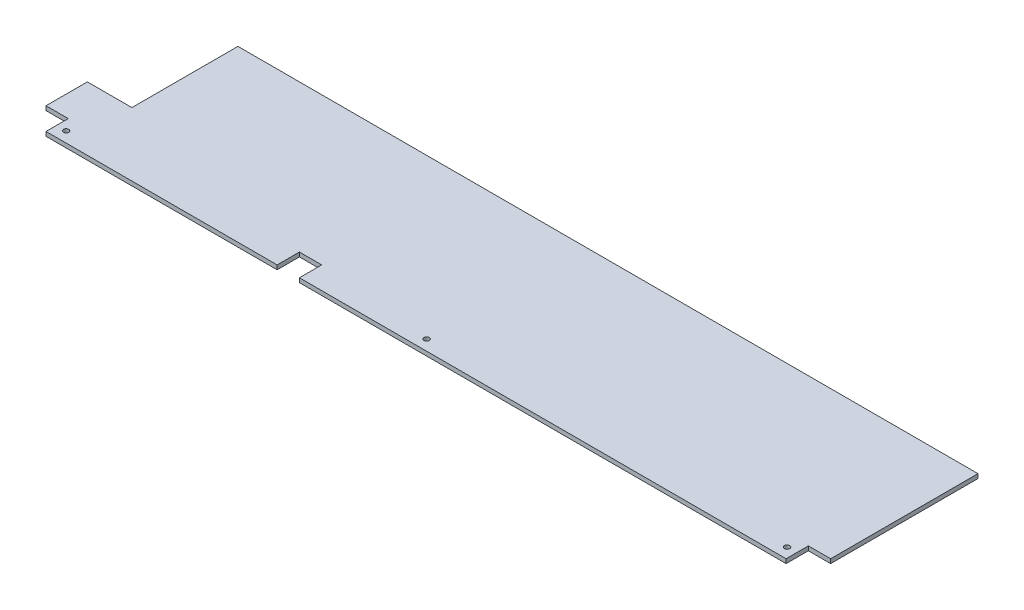
ISO-10303-21;
HEADER;
FILE_DESCRIPTION(('STEP AP214'),'2;1');
FILE_NAME('part.step','',(''),(''),'','','');
FILE_SCHEMA(('AUTOMOTIVE_DESIGN { 1 0 10303 214 1 1 1 1 }'));
ENDSEC;
DATA;
#1=APPLICATION_CONTEXT('core data for automotive mechanical design processes');
#2=APPLICATION_PROTOCOL_DEFINITION('international standard','automotive_design',2000,#1);
#3=PRODUCT_CONTEXT('',#1,'mechanical');
#4=PRODUCT('Part','Part','',(#3));
#5=PRODUCT_RELATED_PRODUCT_CATEGORY('part','',(#4));
#6=PRODUCT_DEFINITION_FORMATION('','',#4);
#7=PRODUCT_DEFINITION_CONTEXT('part definition',#1,'design');
#8=PRODUCT_DEFINITION('design','',#6,#7);
#9=PRODUCT_DEFINITION_SHAPE('','',#8);
#10=(LENGTH_UNIT() NAMED_UNIT(*) SI_UNIT(.MILLI.,.METRE.));
#11=(NAMED_UNIT(*) PLANE_ANGLE_UNIT() SI_UNIT($,.RADIAN.));
#12=(NAMED_UNIT(*) SI_UNIT($,.STERADIAN.) SOLID_ANGLE_UNIT());
#13=UNCERTAINTY_MEASURE_WITH_UNIT(LENGTH_MEASURE(1.E-05),#10,'distance_accuracy_value','');
#14=(GEOMETRIC_REPRESENTATION_CONTEXT(3) GLOBAL_UNCERTAINTY_ASSIGNED_CONTEXT((#13)) GLOBAL_UNIT_ASSIGNED_CONTEXT((#10,
#11,#12)) REPRESENTATION_CONTEXT('',''));
#15=CARTESIAN_POINT('',(0.,0.,0.));
#16=DIRECTION('',(0.,0.,1.));
#17=DIRECTION('',(1.,0.,0.));
#18=AXIS2_PLACEMENT_3D('',#15,#16,#17);
#19=CARTESIAN_POINT('',(0.,4.,0.));
#20=DIRECTION('',(0.,1.,0.));
#21=DIRECTION('',(0.,0.,1.));
#22=AXIS2_PLACEMENT_3D('',#19,#20,#21);
#23=PLANE('',#22);
#24=CARTESIAN_POINT('',(0.,4.,80.0000000000001));
#25=DIRECTION('',(0.,1.,0.));
#26=DIRECTION('',(0.,0.,-1.));
#27=AXIS2_PLACEMENT_3D('',#24,#25,#26);
#28=CIRCLE('',#27,2.5);
#29=CARTESIAN_POINT('',(0.,4.,77.5000000000001));
#30=VERTEX_POINT('',#29);
#31=EDGE_CURVE('E359',#30,#30,#28,.T.);
#32=ORIENTED_EDGE('',*,*,#31,.F.);
#33=EDGE_LOOP('',(#32));
#34=FACE_BOUND('',#33,.T.);
#35=DIRECTION('',(0.,0.,1.));
#36=VECTOR('',#35,1.);
#37=CARTESIAN_POINT('',(-328.,4.,-70.));
#38=LINE('',#37,#36);
#39=CARTESIAN_POINT('',(-328.,4.,-70.));
#40=VERTEX_POINT('',#39);
#41=CARTESIAN_POINT('',(-328.,4.,30.));
#42=VERTEX_POINT('',#41);
#43=EDGE_CURVE('E218',#40,#42,#38,.T.);
#44=ORIENTED_EDGE('',*,*,#43,.T.);
#45=DIRECTION('',(-1.,0.,0.));
#46=VECTOR('',#45,1.);
#47=CARTESIAN_POINT('',(-370.,4.,30.));
#48=LINE('',#47,#46);
#49=CARTESIAN_POINT('',(-370.,4.,30.));
#50=VERTEX_POINT('',#49);
#51=EDGE_CURVE('E118',#42,#50,#48,.T.);
#52=ORIENTED_EDGE('',*,*,#51,.T.);
#53=DIRECTION('',(0.,0.,1.));
#54=VECTOR('',#53,1.);
#55=CARTESIAN_POINT('',(-370.,4.,69.));
#56=LINE('',#55,#54);
#57=CARTESIAN_POINT('',(-370.,4.,69.));
#58=VERTEX_POINT('',#57);
#59=EDGE_CURVE('E263',#50,#58,#56,.T.);
#60=ORIENTED_EDGE('',*,*,#59,.T.);
#61=DIRECTION('',(1.,0.,0.));
#62=VECTOR('',#61,1.);
#63=CARTESIAN_POINT('',(-370.,4.,69.));
#64=LINE('',#63,#62);
#65=CARTESIAN_POINT('',(-349.,4.,69.));
#66=VERTEX_POINT('',#65);
#67=EDGE_CURVE('E283',#58,#66,#64,.T.);
#68=ORIENTED_EDGE('',*,*,#67,.T.);
#69=DIRECTION('',(0.,0.,1.));
#70=VECTOR('',#69,1.);
#71=CARTESIAN_POINT('',(-349.,4.,90.));
#72=LINE('',#71,#70);
#73=CARTESIAN_POINT('',(-349.,4.,90.));
#74=VERTEX_POINT('',#73);
#75=EDGE_CURVE('E279',#66,#74,#72,.T.);
#76=ORIENTED_EDGE('',*,*,#75,.T.);
#77=DIRECTION('',(1.,0.,0.));
#78=VECTOR('',#77,1.);
#79=CARTESIAN_POINT('',(-349.,4.,90.));
#80=LINE('',#79,#78);
#81=CARTESIAN_POINT('',(-131.,4.,90.));
#82=VERTEX_POINT('',#81);
#83=EDGE_CURVE('E282',#74,#82,#80,.T.);
#84=ORIENTED_EDGE('',*,*,#83,.T.);
#85=DIRECTION('',(0.,0.,-1.));
#86=VECTOR('',#85,1.);
#87=CARTESIAN_POINT('',(-131.,4.,90.));
#88=LINE('',#87,#86);
#89=CARTESIAN_POINT('',(-131.,4.,69.));
#90=VERTEX_POINT('',#89);
#91=EDGE_CURVE('E287',#82,#90,#88,.T.);
#92=ORIENTED_EDGE('',*,*,#91,.T.);
#93=DIRECTION('',(1.,0.,0.));
#94=VECTOR('',#93,1.);
#95=CARTESIAN_POINT('',(-131.,4.,69.));
#96=LINE('',#95,#94);
#97=CARTESIAN_POINT('',(-110.,4.,69.));
#98=VERTEX_POINT('',#97);
#99=EDGE_CURVE('E294',#90,#98,#96,.T.);
#100=ORIENTED_EDGE('',*,*,#99,.T.);
#101=DIRECTION('',(0.,0.,1.));
#102=VECTOR('',#101,1.);
#103=CARTESIAN_POINT('',(-110.,4.,90.));
#104=LINE('',#103,#102);
#105=CARTESIAN_POINT('',(-110.,4.,90.));
#106=VERTEX_POINT('',#105);
#107=EDGE_CURVE('E297',#98,#106,#104,.T.);
#108=ORIENTED_EDGE('',*,*,#107,.T.);
#109=DIRECTION('',(1.,0.,0.));
#110=VECTOR('',#109,1.);
#111=CARTESIAN_POINT('',(-110.,4.,90.));
#112=LINE('',#111,#110);
#113=CARTESIAN_POINT('',(349.,4.,90.));
#114=VERTEX_POINT('',#113);
#115=EDGE_CURVE('E300',#106,#114,#112,.T.);
#116=ORIENTED_EDGE('',*,*,#115,.T.);
#117=DIRECTION('',(0.,0.,-1.));
#118=VECTOR('',#117,1.);
#119=CARTESIAN_POINT('',(349.,4.,90.));
#120=LINE('',#119,#118);
#121=CARTESIAN_POINT('',(349.,4.,69.));
#122=VERTEX_POINT('',#121);
#123=EDGE_CURVE('E155',#114,#122,#120,.T.);
#124=ORIENTED_EDGE('',*,*,#123,.T.);
#125=DIRECTION('',(1.,0.,0.));
#126=VECTOR('',#125,1.);
#127=CARTESIAN_POINT('',(349.,4.,69.));
#128=LINE('',#127,#126);
#129=CARTESIAN_POINT('',(370.,4.,69.));
#130=VERTEX_POINT('',#129);
#131=EDGE_CURVE('E149',#122,#130,#128,.T.);
#132=ORIENTED_EDGE('',*,*,#131,.T.);
#133=DIRECTION('',(0.,0.,-1.));
#134=VECTOR('',#133,1.);
#135=CARTESIAN_POINT('',(370.,4.,69.));
#136=LINE('',#135,#134);
#137=CARTESIAN_POINT('',(370.,4.,-70.));
#138=VERTEX_POINT('',#137);
#139=EDGE_CURVE('E153',#130,#138,#136,.T.);
#140=ORIENTED_EDGE('',*,*,#139,.T.);
#141=DIRECTION('',(-1.,0.,0.));
#142=VECTOR('',#141,1.);
#143=CARTESIAN_POINT('',(-328.,4.,-70.));
#144=LINE('',#143,#142);
#145=EDGE_CURVE('E57',#138,#40,#144,.T.);
#146=ORIENTED_EDGE('',*,*,#145,.T.);
#147=EDGE_LOOP('',(#44,#52,#60,#68,#76,#84,#92,#100,#108,#116,#124,#132,#140,#146));
#148=FACE_BOUND('',#147,.T.);
#149=CARTESIAN_POINT('',(-340.,4.,80.));
#150=DIRECTION('',(0.,1.,0.));
#151=DIRECTION('',(0.,0.,-1.));
#152=AXIS2_PLACEMENT_3D('',#149,#150,#151);
#153=CIRCLE('',#152,2.50000000000002);
#154=CARTESIAN_POINT('',(-340.,4.,77.5));
#155=VERTEX_POINT('',#154);
#156=EDGE_CURVE('E182',#155,#155,#153,.T.);
#157=ORIENTED_EDGE('',*,*,#156,.F.);
#158=EDGE_LOOP('',(#157));
#159=FACE_BOUND('',#158,.T.);
#160=CARTESIAN_POINT('',(340.,4.,80.0000000000001));
#161=DIRECTION('',(0.,1.,0.));
#162=DIRECTION('',(0.,0.,1.));
#163=AXIS2_PLACEMENT_3D('',#160,#161,#162);
#164=CIRCLE('',#163,2.50000000000002);
#165=CARTESIAN_POINT('',(340.,4.,82.5000000000001));
#166=VERTEX_POINT('',#165);
#167=EDGE_CURVE('E348',#166,#166,#164,.T.);
#168=ORIENTED_EDGE('',*,*,#167,.F.);
#169=EDGE_LOOP('',(#168));
#170=FACE_BOUND('',#169,.T.);
#171=ADVANCED_FACE('F39',(#34,#148,#159,#170),#23,.T.);
#172=CARTESIAN_POINT('',(0.,0.,0.));
#173=DIRECTION('',(0.,1.,0.));
#174=DIRECTION('',(0.,0.,1.));
#175=AXIS2_PLACEMENT_3D('',#172,#173,#174);
#176=PLANE('',#175);
#177=DIRECTION('',(0.,0.,1.));
#178=VECTOR('',#177,1.);
#179=CARTESIAN_POINT('',(-328.,0.,-70.));
#180=LINE('',#179,#178);
#181=CARTESIAN_POINT('',(-328.,0.,-70.));
#182=VERTEX_POINT('',#181);
#183=CARTESIAN_POINT('',(-328.,0.,30.));
#184=VERTEX_POINT('',#183);
#185=EDGE_CURVE('E177',#182,#184,#180,.T.);
#186=ORIENTED_EDGE('',*,*,#185,.F.);
#187=DIRECTION('',(-1.,0.,0.));
#188=VECTOR('',#187,1.);
#189=CARTESIAN_POINT('',(-328.,0.,-70.));
#190=LINE('',#189,#188);
#191=CARTESIAN_POINT('',(370.,0.,-70.));
#192=VERTEX_POINT('',#191);
#193=EDGE_CURVE('E110',#192,#182,#190,.T.);
#194=ORIENTED_EDGE('',*,*,#193,.F.);
#195=DIRECTION('',(0.,0.,-1.));
#196=VECTOR('',#195,1.);
#197=CARTESIAN_POINT('',(370.,0.,69.));
#198=LINE('',#197,#196);
#199=CARTESIAN_POINT('',(370.,0.,69.));
#200=VERTEX_POINT('',#199);
#201=EDGE_CURVE('E104',#200,#192,#198,.T.);
#202=ORIENTED_EDGE('',*,*,#201,.F.);
#203=DIRECTION('',(1.,0.,0.));
#204=VECTOR('',#203,1.);
#205=CARTESIAN_POINT('',(349.,0.,69.));
#206=LINE('',#205,#204);
#207=CARTESIAN_POINT('',(349.,0.,69.));
#208=VERTEX_POINT('',#207);
#209=EDGE_CURVE('E164',#208,#200,#206,.T.);
#210=ORIENTED_EDGE('',*,*,#209,.F.);
#211=DIRECTION('',(0.,0.,-1.));
#212=VECTOR('',#211,1.);
#213=CARTESIAN_POINT('',(349.,0.,90.));
#214=LINE('',#213,#212);
#215=CARTESIAN_POINT('',(349.,0.,90.));
#216=VERTEX_POINT('',#215);
#217=EDGE_CURVE('E209',#216,#208,#214,.T.);
#218=ORIENTED_EDGE('',*,*,#217,.F.);
#219=DIRECTION('',(1.,0.,0.));
#220=VECTOR('',#219,1.);
#221=CARTESIAN_POINT('',(-110.,0.,90.));
#222=LINE('',#221,#220);
#223=CARTESIAN_POINT('',(-110.,0.,90.));
#224=VERTEX_POINT('',#223);
#225=EDGE_CURVE('E206',#224,#216,#222,.T.);
#226=ORIENTED_EDGE('',*,*,#225,.F.);
#227=DIRECTION('',(0.,0.,1.));
#228=VECTOR('',#227,1.);
#229=CARTESIAN_POINT('',(-110.,0.,90.));
#230=LINE('',#229,#228);
#231=CARTESIAN_POINT('',(-110.,0.,69.));
#232=VERTEX_POINT('',#231);
#233=EDGE_CURVE('E203',#232,#224,#230,.T.);
#234=ORIENTED_EDGE('',*,*,#233,.F.);
#235=DIRECTION('',(1.,0.,0.));
#236=VECTOR('',#235,1.);
#237=CARTESIAN_POINT('',(-131.,0.,69.));
#238=LINE('',#237,#236);
#239=CARTESIAN_POINT('',(-131.,0.,69.));
#240=VERTEX_POINT('',#239);
#241=EDGE_CURVE('E200',#240,#232,#238,.T.);
#242=ORIENTED_EDGE('',*,*,#241,.F.);
#243=DIRECTION('',(0.,0.,-1.));
#244=VECTOR('',#243,1.);
#245=CARTESIAN_POINT('',(-131.,0.,90.));
#246=LINE('',#245,#244);
#247=CARTESIAN_POINT('',(-131.,0.,90.));
#248=VERTEX_POINT('',#247);
#249=EDGE_CURVE('E197',#248,#240,#246,.T.);
#250=ORIENTED_EDGE('',*,*,#249,.F.);
#251=DIRECTION('',(1.,0.,0.));
#252=VECTOR('',#251,1.);
#253=CARTESIAN_POINT('',(-349.,0.,90.));
#254=LINE('',#253,#252);
#255=CARTESIAN_POINT('',(-349.,0.,90.));
#256=VERTEX_POINT('',#255);
#257=EDGE_CURVE('E194',#256,#248,#254,.T.);
#258=ORIENTED_EDGE('',*,*,#257,.F.);
#259=DIRECTION('',(0.,0.,1.));
#260=VECTOR('',#259,1.);
#261=CARTESIAN_POINT('',(-349.,0.,90.));
#262=LINE('',#261,#260);
#263=CARTESIAN_POINT('',(-349.,0.,69.));
#264=VERTEX_POINT('',#263);
#265=EDGE_CURVE('E191',#264,#256,#262,.T.);
#266=ORIENTED_EDGE('',*,*,#265,.F.);
#267=DIRECTION('',(1.,0.,0.));
#268=VECTOR('',#267,1.);
#269=CARTESIAN_POINT('',(-370.,0.,69.));
#270=LINE('',#269,#268);
#271=CARTESIAN_POINT('',(-370.,0.,69.));
#272=VERTEX_POINT('',#271);
#273=EDGE_CURVE('E188',#272,#264,#270,.T.);
#274=ORIENTED_EDGE('',*,*,#273,.F.);
#275=DIRECTION('',(0.,0.,1.));
#276=VECTOR('',#275,1.);
#277=CARTESIAN_POINT('',(-370.,0.,69.));
#278=LINE('',#277,#276);
#279=CARTESIAN_POINT('',(-370.,0.,30.));
#280=VERTEX_POINT('',#279);
#281=EDGE_CURVE('E185',#280,#272,#278,.T.);
#282=ORIENTED_EDGE('',*,*,#281,.F.);
#283=DIRECTION('',(-1.,0.,0.));
#284=VECTOR('',#283,1.);
#285=CARTESIAN_POINT('',(-370.,0.,30.));
#286=LINE('',#285,#284);
#287=EDGE_CURVE('E181',#184,#280,#286,.T.);
#288=ORIENTED_EDGE('',*,*,#287,.F.);
#289=EDGE_LOOP('',(#186,#194,#202,#210,#218,#226,#234,#242,#250,#258,#266,#274,#282,#288));
#290=FACE_BOUND('',#289,.T.);
#291=CARTESIAN_POINT('',(-340.,0.,80.));
#292=DIRECTION('',(0.,1.,0.));
#293=DIRECTION('',(0.,0.,-1.));
#294=AXIS2_PLACEMENT_3D('',#291,#292,#293);
#295=CIRCLE('',#294,2.50000000000002);
#296=CARTESIAN_POINT('',(-340.,0.,77.5));
#297=VERTEX_POINT('',#296);
#298=EDGE_CURVE('E363',#297,#297,#295,.T.);
#299=ORIENTED_EDGE('',*,*,#298,.T.);
#300=EDGE_LOOP('',(#299));
#301=FACE_BOUND('',#300,.T.);
#302=CARTESIAN_POINT('',(0.,0.,80.0000000000001));
#303=DIRECTION('',(0.,1.,0.));
#304=DIRECTION('',(0.,0.,-1.));
#305=AXIS2_PLACEMENT_3D('',#302,#303,#304);
#306=CIRCLE('',#305,2.5);
#307=CARTESIAN_POINT('',(0.,0.,77.5000000000001));
#308=VERTEX_POINT('',#307);
#309=EDGE_CURVE('E356',#308,#308,#306,.T.);
#310=ORIENTED_EDGE('',*,*,#309,.T.);
#311=EDGE_LOOP('',(#310));
#312=FACE_BOUND('',#311,.T.);
#313=CARTESIAN_POINT('',(340.,0.,80.0000000000001));
#314=DIRECTION('',(0.,1.,0.));
#315=DIRECTION('',(0.,0.,1.));
#316=AXIS2_PLACEMENT_3D('',#313,#314,#315);
#317=CIRCLE('',#316,2.50000000000002);
#318=CARTESIAN_POINT('',(340.,0.,82.5000000000001));
#319=VERTEX_POINT('',#318);
#320=EDGE_CURVE('E351',#319,#319,#317,.T.);
#321=ORIENTED_EDGE('',*,*,#320,.T.);
#322=EDGE_LOOP('',(#321));
#323=FACE_BOUND('',#322,.T.);
#324=ADVANCED_FACE('F267',(#290,#301,#312,#323),#176,.F.);
#325=CARTESIAN_POINT('',(-328.,4.,-70.));
#326=DIRECTION('',(1.,0.,0.));
#327=DIRECTION('',(0.,0.,-1.));
#328=AXIS2_PLACEMENT_3D('',#325,#326,#327);
#329=PLANE('',#328);
#330=ORIENTED_EDGE('',*,*,#185,.T.);
#331=DIRECTION('',(0.,-1.,0.));
#332=VECTOR('',#331,1.);
#333=CARTESIAN_POINT('',(-328.,4.,30.));
#334=LINE('',#333,#332);
#335=EDGE_CURVE('E11',#42,#184,#334,.T.);
#336=ORIENTED_EDGE('',*,*,#335,.F.);
#337=ORIENTED_EDGE('',*,*,#43,.F.);
#338=DIRECTION('',(0.,-1.,0.));
#339=VECTOR('',#338,1.);
#340=CARTESIAN_POINT('',(-328.,4.,-70.));
#341=LINE('',#340,#339);
#342=EDGE_CURVE('E173',#40,#182,#341,.T.);
#343=ORIENTED_EDGE('',*,*,#342,.T.);
#344=EDGE_LOOP('',(#330,#336,#337,#343));
#345=FACE_BOUND('',#344,.T.);
#346=ADVANCED_FACE('F41',(#345),#329,.F.);
#347=CARTESIAN_POINT('',(-370.,4.,30.));
#348=DIRECTION('',(0.,0.,1.));
#349=DIRECTION('',(1.,0.,0.));
#350=AXIS2_PLACEMENT_3D('',#347,#348,#349);
#351=PLANE('',#350);
#352=ORIENTED_EDGE('',*,*,#287,.T.);
#353=DIRECTION('',(0.,-1.,0.));
#354=VECTOR('',#353,1.);
#355=CARTESIAN_POINT('',(-370.,4.,30.));
#356=LINE('',#355,#354);
#357=EDGE_CURVE('E49',#50,#280,#356,.T.);
#358=ORIENTED_EDGE('',*,*,#357,.F.);
#359=ORIENTED_EDGE('',*,*,#51,.F.);
#360=ORIENTED_EDGE('',*,*,#335,.T.);
#361=EDGE_LOOP('',(#352,#358,#359,#360));
#362=FACE_BOUND('',#361,.T.);
#363=ADVANCED_FACE('F491',(#362),#351,.F.);
#364=CARTESIAN_POINT('',(-370.,4.,69.));
#365=DIRECTION('',(1.,0.,0.));
#366=DIRECTION('',(0.,0.,-1.));
#367=AXIS2_PLACEMENT_3D('',#364,#365,#366);
#368=PLANE('',#367);
#369=ORIENTED_EDGE('',*,*,#281,.T.);
#370=DIRECTION('',(0.,-1.,0.));
#371=VECTOR('',#370,1.);
#372=CARTESIAN_POINT('',(-370.,4.,69.));
#373=LINE('',#372,#371);
#374=EDGE_CURVE('E253',#58,#272,#373,.T.);
#375=ORIENTED_EDGE('',*,*,#374,.F.);
#376=ORIENTED_EDGE('',*,*,#59,.F.);
#377=ORIENTED_EDGE('',*,*,#357,.T.);
#378=EDGE_LOOP('',(#369,#375,#376,#377));
#379=FACE_BOUND('',#378,.T.);
#380=ADVANCED_FACE('F261',(#379),#368,.F.);
#381=CARTESIAN_POINT('',(-370.,4.,69.));
#382=DIRECTION('',(0.,0.,-1.));
#383=DIRECTION('',(-1.,0.,0.));
#384=AXIS2_PLACEMENT_3D('',#381,#382,#383);
#385=PLANE('',#384);
#386=ORIENTED_EDGE('',*,*,#273,.T.);
#387=DIRECTION('',(0.,-1.,0.));
#388=VECTOR('',#387,1.);
#389=CARTESIAN_POINT('',(-349.,4.,69.));
#390=LINE('',#389,#388);
#391=EDGE_CURVE('E249',#66,#264,#390,.T.);
#392=ORIENTED_EDGE('',*,*,#391,.F.);
#393=ORIENTED_EDGE('',*,*,#67,.F.);
#394=ORIENTED_EDGE('',*,*,#374,.T.);
#395=EDGE_LOOP('',(#386,#392,#393,#394));
#396=FACE_BOUND('',#395,.T.);
#397=ADVANCED_FACE('F273',(#396),#385,.F.);
#398=CARTESIAN_POINT('',(-349.,4.,90.));
#399=DIRECTION('',(1.,0.,0.));
#400=DIRECTION('',(0.,0.,-1.));
#401=AXIS2_PLACEMENT_3D('',#398,#399,#400);
#402=PLANE('',#401);
#403=ORIENTED_EDGE('',*,*,#265,.T.);
#404=DIRECTION('',(0.,-1.,0.));
#405=VECTOR('',#404,1.);
#406=CARTESIAN_POINT('',(-349.,4.,90.));
#407=LINE('',#406,#405);
#408=EDGE_CURVE('E245',#74,#256,#407,.T.);
#409=ORIENTED_EDGE('',*,*,#408,.F.);
#410=ORIENTED_EDGE('',*,*,#75,.F.);
#411=ORIENTED_EDGE('',*,*,#391,.T.);
#412=EDGE_LOOP('',(#403,#409,#410,#411));
#413=FACE_BOUND('',#412,.T.);
#414=ADVANCED_FACE('F277',(#413),#402,.F.);
#415=CARTESIAN_POINT('',(-349.,4.,90.));
#416=DIRECTION('',(0.,0.,-1.));
#417=DIRECTION('',(-1.,0.,0.));
#418=AXIS2_PLACEMENT_3D('',#415,#416,#417);
#419=PLANE('',#418);
#420=ORIENTED_EDGE('',*,*,#257,.T.);
#421=DIRECTION('',(0.,-1.,0.));
#422=VECTOR('',#421,1.);
#423=CARTESIAN_POINT('',(-131.,4.,90.));
#424=LINE('',#423,#422);
#425=EDGE_CURVE('E241',#82,#248,#424,.T.);
#426=ORIENTED_EDGE('',*,*,#425,.F.);
#427=ORIENTED_EDGE('',*,*,#83,.F.);
#428=ORIENTED_EDGE('',*,*,#408,.T.);
#429=EDGE_LOOP('',(#420,#426,#427,#428));
#430=FACE_BOUND('',#429,.T.);
#431=ADVANCED_FACE('F456',(#430),#419,.F.);
#432=CARTESIAN_POINT('',(-131.,4.,90.));
#433=DIRECTION('',(-1.,0.,0.));
#434=DIRECTION('',(0.,0.,1.));
#435=AXIS2_PLACEMENT_3D('',#432,#433,#434);
#436=PLANE('',#435);
#437=ORIENTED_EDGE('',*,*,#249,.T.);
#438=DIRECTION('',(0.,-1.,0.));
#439=VECTOR('',#438,1.);
#440=CARTESIAN_POINT('',(-131.,4.,69.));
#441=LINE('',#440,#439);
#442=EDGE_CURVE('E237',#90,#240,#441,.T.);
#443=ORIENTED_EDGE('',*,*,#442,.F.);
#444=ORIENTED_EDGE('',*,*,#91,.F.);
#445=ORIENTED_EDGE('',*,*,#425,.T.);
#446=EDGE_LOOP('',(#437,#443,#444,#445));
#447=FACE_BOUND('',#446,.T.);
#448=ADVANCED_FACE('F446',(#447),#436,.F.);
#449=CARTESIAN_POINT('',(-131.,4.,69.));
#450=DIRECTION('',(0.,0.,-1.));
#451=DIRECTION('',(-1.,0.,0.));
#452=AXIS2_PLACEMENT_3D('',#449,#450,#451);
#453=PLANE('',#452);
#454=ORIENTED_EDGE('',*,*,#241,.T.);
#455=DIRECTION('',(0.,-1.,0.));
#456=VECTOR('',#455,1.);
#457=CARTESIAN_POINT('',(-110.,4.,69.));
#458=LINE('',#457,#456);
#459=EDGE_CURVE('E233',#98,#232,#458,.T.);
#460=ORIENTED_EDGE('',*,*,#459,.F.);
#461=ORIENTED_EDGE('',*,*,#99,.F.);
#462=ORIENTED_EDGE('',*,*,#442,.T.);
#463=EDGE_LOOP('',(#454,#460,#461,#462));
#464=FACE_BOUND('',#463,.T.);
#465=ADVANCED_FACE('F436',(#464),#453,.F.);
#466=CARTESIAN_POINT('',(-110.,4.,90.));
#467=DIRECTION('',(1.,0.,0.));
#468=DIRECTION('',(0.,0.,-1.));
#469=AXIS2_PLACEMENT_3D('',#466,#467,#468);
#470=PLANE('',#469);
#471=ORIENTED_EDGE('',*,*,#233,.T.);
#472=DIRECTION('',(0.,-1.,0.));
#473=VECTOR('',#472,1.);
#474=CARTESIAN_POINT('',(-110.,4.,90.));
#475=LINE('',#474,#473);
#476=EDGE_CURVE('E229',#106,#224,#475,.T.);
#477=ORIENTED_EDGE('',*,*,#476,.F.);
#478=ORIENTED_EDGE('',*,*,#107,.F.);
#479=ORIENTED_EDGE('',*,*,#459,.T.);
#480=EDGE_LOOP('',(#471,#477,#478,#479));
#481=FACE_BOUND('',#480,.T.);
#482=ADVANCED_FACE('F427',(#481),#470,.F.);
#483=CARTESIAN_POINT('',(-110.,4.,90.));
#484=DIRECTION('',(0.,0.,-1.));
#485=DIRECTION('',(-1.,0.,0.));
#486=AXIS2_PLACEMENT_3D('',#483,#484,#485);
#487=PLANE('',#486);
#488=ORIENTED_EDGE('',*,*,#225,.T.);
#489=DIRECTION('',(0.,-1.,0.));
#490=VECTOR('',#489,1.);
#491=CARTESIAN_POINT('',(349.,4.,90.));
#492=LINE('',#491,#490);
#493=EDGE_CURVE('E225',#114,#216,#492,.T.);
#494=ORIENTED_EDGE('',*,*,#493,.F.);
#495=ORIENTED_EDGE('',*,*,#115,.F.);
#496=ORIENTED_EDGE('',*,*,#476,.T.);
#497=EDGE_LOOP('',(#488,#494,#495,#496));
#498=FACE_BOUND('',#497,.T.);
#499=ADVANCED_FACE('F308',(#498),#487,.F.);
#500=CARTESIAN_POINT('',(349.,4.,90.));
#501=DIRECTION('',(-1.,0.,0.));
#502=DIRECTION('',(0.,0.,1.));
#503=AXIS2_PLACEMENT_3D('',#500,#501,#502);
#504=PLANE('',#503);
#505=ORIENTED_EDGE('',*,*,#217,.T.);
#506=DIRECTION('',(0.,-1.,0.));
#507=VECTOR('',#506,1.);
#508=CARTESIAN_POINT('',(349.,4.,69.));
#509=LINE('',#508,#507);
#510=EDGE_CURVE('E166',#122,#208,#509,.T.);
#511=ORIENTED_EDGE('',*,*,#510,.F.);
#512=ORIENTED_EDGE('',*,*,#123,.F.);
#513=ORIENTED_EDGE('',*,*,#493,.T.);
#514=EDGE_LOOP('',(#505,#511,#512,#513));
#515=FACE_BOUND('',#514,.T.);
#516=ADVANCED_FACE('F312',(#515),#504,.F.);
#517=CARTESIAN_POINT('',(349.,4.,69.));
#518=DIRECTION('',(0.,0.,-1.));
#519=DIRECTION('',(-1.,0.,0.));
#520=AXIS2_PLACEMENT_3D('',#517,#518,#519);
#521=PLANE('',#520);
#522=ORIENTED_EDGE('',*,*,#209,.T.);
#523=DIRECTION('',(0.,-1.,0.));
#524=VECTOR('',#523,1.);
#525=CARTESIAN_POINT('',(370.,4.,69.));
#526=LINE('',#525,#524);
#527=EDGE_CURVE('E161',#130,#200,#526,.T.);
#528=ORIENTED_EDGE('',*,*,#527,.F.);
#529=ORIENTED_EDGE('',*,*,#131,.F.);
#530=ORIENTED_EDGE('',*,*,#510,.T.);
#531=EDGE_LOOP('',(#522,#528,#529,#530));
#532=FACE_BOUND('',#531,.T.);
#533=ADVANCED_FACE('F162',(#532),#521,.F.);
#534=CARTESIAN_POINT('',(370.,4.,69.));
#535=DIRECTION('',(-1.,0.,0.));
#536=DIRECTION('',(0.,0.,1.));
#537=AXIS2_PLACEMENT_3D('',#534,#535,#536);
#538=PLANE('',#537);
#539=ORIENTED_EDGE('',*,*,#201,.T.);
#540=DIRECTION('',(0.,-1.,0.));
#541=VECTOR('',#540,1.);
#542=CARTESIAN_POINT('',(370.,4.,-70.));
#543=LINE('',#542,#541);
#544=EDGE_CURVE('E167',#138,#192,#543,.T.);
#545=ORIENTED_EDGE('',*,*,#544,.F.);
#546=ORIENTED_EDGE('',*,*,#139,.F.);
#547=ORIENTED_EDGE('',*,*,#527,.T.);
#548=EDGE_LOOP('',(#539,#545,#546,#547));
#549=FACE_BOUND('',#548,.T.);
#550=ADVANCED_FACE('F169',(#549),#538,.F.);
#551=CARTESIAN_POINT('',(-328.,4.,-70.));
#552=DIRECTION('',(0.,0.,1.));
#553=DIRECTION('',(1.,0.,0.));
#554=AXIS2_PLACEMENT_3D('',#551,#552,#553);
#555=PLANE('',#554);
#556=ORIENTED_EDGE('',*,*,#193,.T.);
#557=ORIENTED_EDGE('',*,*,#342,.F.);
#558=ORIENTED_EDGE('',*,*,#145,.F.);
#559=ORIENTED_EDGE('',*,*,#544,.T.);
#560=EDGE_LOOP('',(#556,#557,#558,#559));
#561=FACE_BOUND('',#560,.T.);
#562=ADVANCED_FACE('F316',(#561),#555,.F.);
#563=CARTESIAN_POINT('',(-340.,4.,80.));
#564=DIRECTION('',(0.,-1.,0.));
#565=DIRECTION('',(0.,0.,-1.));
#566=AXIS2_PLACEMENT_3D('',#563,#564,#565);
#567=CYLINDRICAL_SURFACE('',#566,2.50000000000002);
#568=ORIENTED_EDGE('',*,*,#156,.T.);
#569=EDGE_LOOP('',(#568));
#570=FACE_BOUND('',#569,.T.);
#571=ORIENTED_EDGE('',*,*,#298,.F.);
#572=EDGE_LOOP('',(#571));
#573=FACE_BOUND('',#572,.T.);
#574=ADVANCED_FACE('F318',(#570,#573),#567,.F.);
#575=CARTESIAN_POINT('',(0.,4.,80.0000000000001));
#576=DIRECTION('',(0.,-1.,0.));
#577=DIRECTION('',(0.,0.,-1.));
#578=AXIS2_PLACEMENT_3D('',#575,#576,#577);
#579=CYLINDRICAL_SURFACE('',#578,2.5);
#580=ORIENTED_EDGE('',*,*,#31,.T.);
#581=EDGE_LOOP('',(#580));
#582=FACE_BOUND('',#581,.T.);
#583=ORIENTED_EDGE('',*,*,#309,.F.);
#584=EDGE_LOOP('',(#583));
#585=FACE_BOUND('',#584,.T.);
#586=ADVANCED_FACE('F324',(#582,#585),#579,.F.);
#587=CARTESIAN_POINT('',(340.,4.,80.0000000000001));
#588=DIRECTION('',(0.,-1.,0.));
#589=DIRECTION('',(0.,0.,-1.));
#590=AXIS2_PLACEMENT_3D('',#587,#588,#589);
#591=CYLINDRICAL_SURFACE('',#590,2.50000000000002);
#592=ORIENTED_EDGE('',*,*,#167,.T.);
#593=EDGE_LOOP('',(#592));
#594=FACE_BOUND('',#593,.T.);
#595=ORIENTED_EDGE('',*,*,#320,.F.);
#596=EDGE_LOOP('',(#595));
#597=FACE_BOUND('',#596,.T.);
#598=ADVANCED_FACE('F339',(#594,#597),#591,.F.);
#599=CLOSED_SHELL('',(#171,#324,#346,#363,#380,#397,#414,#431,#448,#465,#482,#499,#516,#533,
#550,#562,#574,#586,#598));
#600=MANIFOLD_SOLID_BREP('B2',#599);
#601=ADVANCED_BREP_SHAPE_REPRESENTATION('',(#18,#600),#14);
#602=SHAPE_DEFINITION_REPRESENTATION(#9,#601);
ENDSEC;
END-ISO-10303-21;
